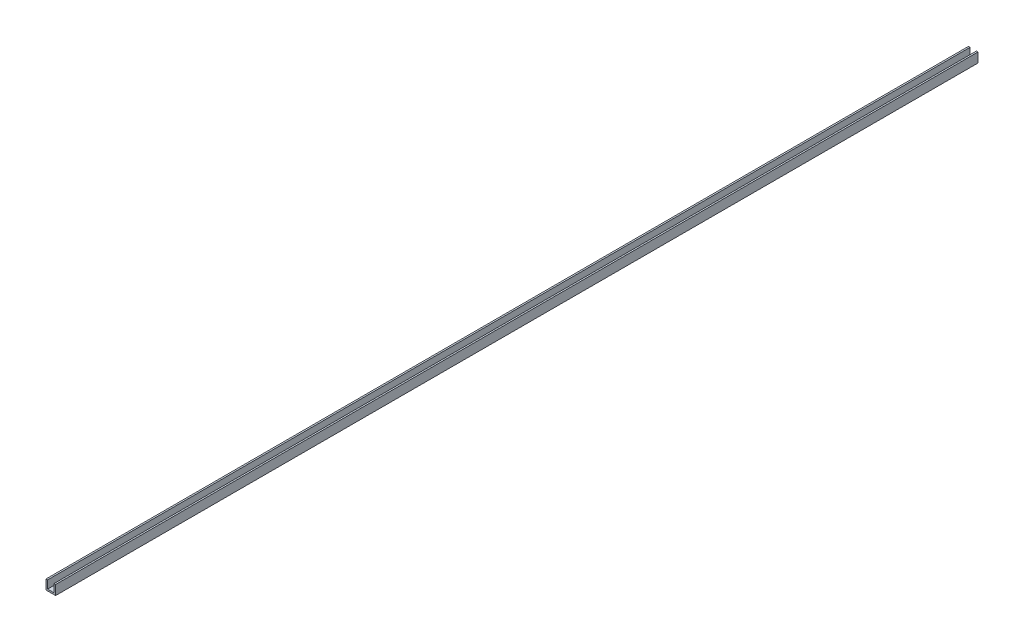
ISO-10303-21;
HEADER;
FILE_DESCRIPTION(('STEP AP214'),'2;1');
FILE_NAME('part.step','',(''),(''),'','','');
FILE_SCHEMA(('AUTOMOTIVE_DESIGN { 1 0 10303 214 1 1 1 1 }'));
ENDSEC;
DATA;
#1=APPLICATION_CONTEXT('core data for automotive mechanical design processes');
#2=APPLICATION_PROTOCOL_DEFINITION('international standard','automotive_design',2000,#1);
#3=PRODUCT_CONTEXT('',#1,'mechanical');
#4=PRODUCT('Part','Part','',(#3));
#5=PRODUCT_RELATED_PRODUCT_CATEGORY('part','',(#4));
#6=PRODUCT_DEFINITION_FORMATION('','',#4);
#7=PRODUCT_DEFINITION_CONTEXT('part definition',#1,'design');
#8=PRODUCT_DEFINITION('design','',#6,#7);
#9=PRODUCT_DEFINITION_SHAPE('','',#8);
#10=(LENGTH_UNIT() NAMED_UNIT(*) SI_UNIT(.MILLI.,.METRE.));
#11=(NAMED_UNIT(*) PLANE_ANGLE_UNIT() SI_UNIT($,.RADIAN.));
#12=(NAMED_UNIT(*) SI_UNIT($,.STERADIAN.) SOLID_ANGLE_UNIT());
#13=UNCERTAINTY_MEASURE_WITH_UNIT(LENGTH_MEASURE(1.E-05),#10,'distance_accuracy_value','');
#14=(GEOMETRIC_REPRESENTATION_CONTEXT(3) GLOBAL_UNCERTAINTY_ASSIGNED_CONTEXT((#13)) GLOBAL_UNIT_ASSIGNED_CONTEXT((#10,
#11,#12)) REPRESENTATION_CONTEXT('',''));
#15=CARTESIAN_POINT('',(0.,0.,0.));
#16=DIRECTION('',(0.,0.,1.));
#17=DIRECTION('',(1.,0.,0.));
#18=AXIS2_PLACEMENT_3D('',#15,#16,#17);
#19=CARTESIAN_POINT('',(3.175,0.,1828.8));
#20=DIRECTION('',(0.,-1.,0.));
#21=DIRECTION('',(0.,0.,-1.));
#22=AXIS2_PLACEMENT_3D('',#19,#20,#21);
#23=PLANE('',#22);
#24=DIRECTION('',(-1.,0.,0.));
#25=VECTOR('',#24,1.);
#26=CARTESIAN_POINT('',(3.175,0.,0.));
#27=LINE('',#26,#25);
#28=CARTESIAN_POINT('',(3.175,0.,0.));
#29=VERTEX_POINT('',#28);
#30=CARTESIAN_POINT('',(0.,0.,0.));
#31=VERTEX_POINT('',#30);
#32=EDGE_CURVE('E128',#29,#31,#27,.T.);
#33=ORIENTED_EDGE('',*,*,#32,.T.);
#34=DIRECTION('',(0.,0.,-1.));
#35=VECTOR('',#34,1.);
#36=CARTESIAN_POINT('',(0.,0.,1828.8));
#37=LINE('',#36,#35);
#38=CARTESIAN_POINT('',(0.,0.,1828.8));
#39=VERTEX_POINT('',#38);
#40=EDGE_CURVE('E11',#39,#31,#37,.T.);
#41=ORIENTED_EDGE('',*,*,#40,.F.);
#42=DIRECTION('',(-1.,0.,0.));
#43=VECTOR('',#42,1.);
#44=CARTESIAN_POINT('',(3.175,0.,1828.8));
#45=LINE('',#44,#43);
#46=CARTESIAN_POINT('',(3.175,0.,1828.8));
#47=VERTEX_POINT('',#46);
#48=EDGE_CURVE('E142',#47,#39,#45,.T.);
#49=ORIENTED_EDGE('',*,*,#48,.F.);
#50=DIRECTION('',(0.,0.,-1.));
#51=VECTOR('',#50,1.);
#52=CARTESIAN_POINT('',(3.175,0.,1828.8));
#53=LINE('',#52,#51);
#54=EDGE_CURVE('E124',#47,#29,#53,.T.);
#55=ORIENTED_EDGE('',*,*,#54,.T.);
#56=EDGE_LOOP('',(#33,#41,#49,#55));
#57=FACE_BOUND('',#56,.T.);
#58=ADVANCED_FACE('F32',(#57),#23,.F.);
#59=CARTESIAN_POINT('',(0.,0.,1828.8));
#60=DIRECTION('',(1.,0.,0.));
#61=DIRECTION('',(0.,1.,0.));
#62=AXIS2_PLACEMENT_3D('',#59,#60,#61);
#63=PLANE('',#62);
#64=DIRECTION('',(0.,-1.,0.));
#65=VECTOR('',#64,1.);
#66=CARTESIAN_POINT('',(0.,0.,0.));
#67=LINE('',#66,#65);
#68=CARTESIAN_POINT('',(0.,-19.05,0.));
#69=VERTEX_POINT('',#68);
#70=EDGE_CURVE('E131',#31,#69,#67,.T.);
#71=ORIENTED_EDGE('',*,*,#70,.T.);
#72=DIRECTION('',(0.,0.,-1.));
#73=VECTOR('',#72,1.);
#74=CARTESIAN_POINT('',(0.,-19.05,1828.8));
#75=LINE('',#74,#73);
#76=CARTESIAN_POINT('',(0.,-19.05,1828.8));
#77=VERTEX_POINT('',#76);
#78=EDGE_CURVE('E40',#77,#69,#75,.T.);
#79=ORIENTED_EDGE('',*,*,#78,.F.);
#80=DIRECTION('',(0.,-1.,0.));
#81=VECTOR('',#80,1.);
#82=CARTESIAN_POINT('',(0.,0.,1828.8));
#83=LINE('',#82,#81);
#84=EDGE_CURVE('E91',#39,#77,#83,.T.);
#85=ORIENTED_EDGE('',*,*,#84,.F.);
#86=ORIENTED_EDGE('',*,*,#40,.T.);
#87=EDGE_LOOP('',(#71,#79,#85,#86));
#88=FACE_BOUND('',#87,.T.);
#89=ADVANCED_FACE('F177',(#88),#63,.F.);
#90=CARTESIAN_POINT('',(0.,-19.05,1828.8));
#91=DIRECTION('',(0.,1.,0.));
#92=DIRECTION('',(0.,0.,1.));
#93=AXIS2_PLACEMENT_3D('',#90,#91,#92);
#94=PLANE('',#93);
#95=DIRECTION('',(1.,0.,0.));
#96=VECTOR('',#95,1.);
#97=CARTESIAN_POINT('',(0.,-19.05,0.));
#98=LINE('',#97,#96);
#99=CARTESIAN_POINT('',(19.05,-19.05,0.));
#100=VERTEX_POINT('',#99);
#101=EDGE_CURVE('E133',#69,#100,#98,.T.);
#102=ORIENTED_EDGE('',*,*,#101,.T.);
#103=DIRECTION('',(0.,0.,-1.));
#104=VECTOR('',#103,1.);
#105=CARTESIAN_POINT('',(19.05,-19.05,1828.8));
#106=LINE('',#105,#104);
#107=CARTESIAN_POINT('',(19.05,-19.05,1828.8));
#108=VERTEX_POINT('',#107);
#109=EDGE_CURVE('E149',#108,#100,#106,.T.);
#110=ORIENTED_EDGE('',*,*,#109,.F.);
#111=DIRECTION('',(1.,0.,0.));
#112=VECTOR('',#111,1.);
#113=CARTESIAN_POINT('',(0.,-19.05,1828.8));
#114=LINE('',#113,#112);
#115=EDGE_CURVE('E157',#77,#108,#114,.T.);
#116=ORIENTED_EDGE('',*,*,#115,.F.);
#117=ORIENTED_EDGE('',*,*,#78,.T.);
#118=EDGE_LOOP('',(#102,#110,#116,#117));
#119=FACE_BOUND('',#118,.T.);
#120=ADVANCED_FACE('F155',(#119),#94,.F.);
#121=CARTESIAN_POINT('',(19.05,-19.05,1828.8));
#122=DIRECTION('',(-1.,0.,0.));
#123=DIRECTION('',(0.,0.,1.));
#124=AXIS2_PLACEMENT_3D('',#121,#122,#123);
#125=PLANE('',#124);
#126=DIRECTION('',(0.,1.,0.));
#127=VECTOR('',#126,1.);
#128=CARTESIAN_POINT('',(19.05,-19.05,0.));
#129=LINE('',#128,#127);
#130=CARTESIAN_POINT('',(19.05,0.,0.));
#131=VERTEX_POINT('',#130);
#132=EDGE_CURVE('E135',#100,#131,#129,.T.);
#133=ORIENTED_EDGE('',*,*,#132,.T.);
#134=DIRECTION('',(0.,0.,-1.));
#135=VECTOR('',#134,1.);
#136=CARTESIAN_POINT('',(19.05,0.,1828.8));
#137=LINE('',#136,#135);
#138=CARTESIAN_POINT('',(19.05,0.,1828.8));
#139=VERTEX_POINT('',#138);
#140=EDGE_CURVE('E146',#139,#131,#137,.T.);
#141=ORIENTED_EDGE('',*,*,#140,.F.);
#142=DIRECTION('',(0.,1.,0.));
#143=VECTOR('',#142,1.);
#144=CARTESIAN_POINT('',(19.05,-19.05,1828.8));
#145=LINE('',#144,#143);
#146=EDGE_CURVE('E169',#108,#139,#145,.T.);
#147=ORIENTED_EDGE('',*,*,#146,.F.);
#148=ORIENTED_EDGE('',*,*,#109,.T.);
#149=EDGE_LOOP('',(#133,#141,#147,#148));
#150=FACE_BOUND('',#149,.T.);
#151=ADVANCED_FACE('F165',(#150),#125,.F.);
#152=CARTESIAN_POINT('',(19.05,0.,1828.8));
#153=DIRECTION('',(0.,-1.,0.));
#154=DIRECTION('',(1.,0.,0.));
#155=AXIS2_PLACEMENT_3D('',#152,#153,#154);
#156=PLANE('',#155);
#157=DIRECTION('',(-1.,0.,0.));
#158=VECTOR('',#157,1.);
#159=CARTESIAN_POINT('',(19.05,0.,0.));
#160=LINE('',#159,#158);
#161=CARTESIAN_POINT('',(15.875,0.,0.));
#162=VERTEX_POINT('',#161);
#163=EDGE_CURVE('E137',#131,#162,#160,.T.);
#164=ORIENTED_EDGE('',*,*,#163,.T.);
#165=DIRECTION('',(0.,0.,-1.));
#166=VECTOR('',#165,1.);
#167=CARTESIAN_POINT('',(15.875,0.,1828.8));
#168=LINE('',#167,#166);
#169=CARTESIAN_POINT('',(15.875,0.,1828.8));
#170=VERTEX_POINT('',#169);
#171=EDGE_CURVE('E119',#170,#162,#168,.T.);
#172=ORIENTED_EDGE('',*,*,#171,.F.);
#173=DIRECTION('',(-1.,0.,0.));
#174=VECTOR('',#173,1.);
#175=CARTESIAN_POINT('',(19.05,0.,1828.8));
#176=LINE('',#175,#174);
#177=EDGE_CURVE('E110',#139,#170,#176,.T.);
#178=ORIENTED_EDGE('',*,*,#177,.F.);
#179=ORIENTED_EDGE('',*,*,#140,.T.);
#180=EDGE_LOOP('',(#164,#172,#178,#179));
#181=FACE_BOUND('',#180,.T.);
#182=ADVANCED_FACE('F168',(#181),#156,.F.);
#183=CARTESIAN_POINT('',(15.875,0.,1828.8));
#184=DIRECTION('',(1.,0.,0.));
#185=DIRECTION('',(0.,1.,0.));
#186=AXIS2_PLACEMENT_3D('',#183,#184,#185);
#187=PLANE('',#186);
#188=DIRECTION('',(0.,-1.,0.));
#189=VECTOR('',#188,1.);
#190=CARTESIAN_POINT('',(15.875,0.,0.));
#191=LINE('',#190,#189);
#192=CARTESIAN_POINT('',(15.875,-15.875,0.));
#193=VERTEX_POINT('',#192);
#194=EDGE_CURVE('E118',#162,#193,#191,.T.);
#195=ORIENTED_EDGE('',*,*,#194,.T.);
#196=DIRECTION('',(0.,0.,-1.));
#197=VECTOR('',#196,1.);
#198=CARTESIAN_POINT('',(15.875,-15.875,1828.8));
#199=LINE('',#198,#197);
#200=CARTESIAN_POINT('',(15.875,-15.875,1828.8));
#201=VERTEX_POINT('',#200);
#202=EDGE_CURVE('E115',#201,#193,#199,.T.);
#203=ORIENTED_EDGE('',*,*,#202,.F.);
#204=DIRECTION('',(0.,-1.,0.));
#205=VECTOR('',#204,1.);
#206=CARTESIAN_POINT('',(15.875,0.,1828.8));
#207=LINE('',#206,#205);
#208=EDGE_CURVE('E104',#170,#201,#207,.T.);
#209=ORIENTED_EDGE('',*,*,#208,.F.);
#210=ORIENTED_EDGE('',*,*,#171,.T.);
#211=EDGE_LOOP('',(#195,#203,#209,#210));
#212=FACE_BOUND('',#211,.T.);
#213=ADVANCED_FACE('F116',(#212),#187,.F.);
#214=CARTESIAN_POINT('',(15.875,-15.875,1828.8));
#215=DIRECTION('',(0.,-1.,0.));
#216=DIRECTION('',(0.,0.,-1.));
#217=AXIS2_PLACEMENT_3D('',#214,#215,#216);
#218=PLANE('',#217);
#219=DIRECTION('',(-1.,0.,0.));
#220=VECTOR('',#219,1.);
#221=CARTESIAN_POINT('',(15.875,-15.875,0.));
#222=LINE('',#221,#220);
#223=CARTESIAN_POINT('',(3.175,-15.875,0.));
#224=VERTEX_POINT('',#223);
#225=EDGE_CURVE('E77',#193,#224,#222,.T.);
#226=ORIENTED_EDGE('',*,*,#225,.T.);
#227=DIRECTION('',(0.,0.,-1.));
#228=VECTOR('',#227,1.);
#229=CARTESIAN_POINT('',(3.175,-15.875,1828.8));
#230=LINE('',#229,#228);
#231=CARTESIAN_POINT('',(3.175,-15.875,1828.8));
#232=VERTEX_POINT('',#231);
#233=EDGE_CURVE('E120',#232,#224,#230,.T.);
#234=ORIENTED_EDGE('',*,*,#233,.F.);
#235=DIRECTION('',(-1.,0.,0.));
#236=VECTOR('',#235,1.);
#237=CARTESIAN_POINT('',(15.875,-15.875,1828.8));
#238=LINE('',#237,#236);
#239=EDGE_CURVE('E108',#201,#232,#238,.T.);
#240=ORIENTED_EDGE('',*,*,#239,.F.);
#241=ORIENTED_EDGE('',*,*,#202,.T.);
#242=EDGE_LOOP('',(#226,#234,#240,#241));
#243=FACE_BOUND('',#242,.T.);
#244=ADVANCED_FACE('F122',(#243),#218,.F.);
#245=CARTESIAN_POINT('',(3.175,-15.875,1828.8));
#246=DIRECTION('',(-1.,0.,0.));
#247=DIRECTION('',(0.,0.,1.));
#248=AXIS2_PLACEMENT_3D('',#245,#246,#247);
#249=PLANE('',#248);
#250=DIRECTION('',(0.,1.,0.));
#251=VECTOR('',#250,1.);
#252=CARTESIAN_POINT('',(3.175,-15.875,0.));
#253=LINE('',#252,#251);
#254=EDGE_CURVE('E83',#224,#29,#253,.T.);
#255=ORIENTED_EDGE('',*,*,#254,.T.);
#256=ORIENTED_EDGE('',*,*,#54,.F.);
#257=DIRECTION('',(0.,1.,0.));
#258=VECTOR('',#257,1.);
#259=CARTESIAN_POINT('',(3.175,-15.875,1828.8));
#260=LINE('',#259,#258);
#261=EDGE_CURVE('E48',#232,#47,#260,.T.);
#262=ORIENTED_EDGE('',*,*,#261,.F.);
#263=ORIENTED_EDGE('',*,*,#233,.T.);
#264=EDGE_LOOP('',(#255,#256,#262,#263));
#265=FACE_BOUND('',#264,.T.);
#266=ADVANCED_FACE('F193',(#265),#249,.F.);
#267=CARTESIAN_POINT('',(0.,0.,1828.8));
#268=DIRECTION('',(0.,0.,1.));
#269=DIRECTION('',(1.,0.,0.));
#270=AXIS2_PLACEMENT_3D('',#267,#268,#269);
#271=PLANE('',#270);
#272=ORIENTED_EDGE('',*,*,#48,.T.);
#273=ORIENTED_EDGE('',*,*,#84,.T.);
#274=ORIENTED_EDGE('',*,*,#115,.T.);
#275=ORIENTED_EDGE('',*,*,#146,.T.);
#276=ORIENTED_EDGE('',*,*,#177,.T.);
#277=ORIENTED_EDGE('',*,*,#208,.T.);
#278=ORIENTED_EDGE('',*,*,#239,.T.);
#279=ORIENTED_EDGE('',*,*,#261,.T.);
#280=EDGE_LOOP('',(#272,#273,#274,#275,#276,#277,#278,#279));
#281=FACE_BOUND('',#280,.T.);
#282=ADVANCED_FACE('F106',(#281),#271,.T.);
#283=CARTESIAN_POINT('',(0.,0.,0.));
#284=DIRECTION('',(0.,0.,1.));
#285=DIRECTION('',(1.,0.,0.));
#286=AXIS2_PLACEMENT_3D('',#283,#284,#285);
#287=PLANE('',#286);
#288=ORIENTED_EDGE('',*,*,#32,.F.);
#289=ORIENTED_EDGE('',*,*,#254,.F.);
#290=ORIENTED_EDGE('',*,*,#225,.F.);
#291=ORIENTED_EDGE('',*,*,#194,.F.);
#292=ORIENTED_EDGE('',*,*,#163,.F.);
#293=ORIENTED_EDGE('',*,*,#132,.F.);
#294=ORIENTED_EDGE('',*,*,#101,.F.);
#295=ORIENTED_EDGE('',*,*,#70,.F.);
#296=EDGE_LOOP('',(#288,#289,#290,#291,#292,#293,#294,#295));
#297=FACE_BOUND('',#296,.T.);
#298=ADVANCED_FACE('F161',(#297),#287,.F.);
#299=CLOSED_SHELL('',(#58,#89,#120,#151,#182,#213,#244,#266,#282,#298));
#300=MANIFOLD_SOLID_BREP('B2',#299);
#301=ADVANCED_BREP_SHAPE_REPRESENTATION('',(#18,#300),#14);
#302=SHAPE_DEFINITION_REPRESENTATION(#9,#301);
ENDSEC;
END-ISO-10303-21;
